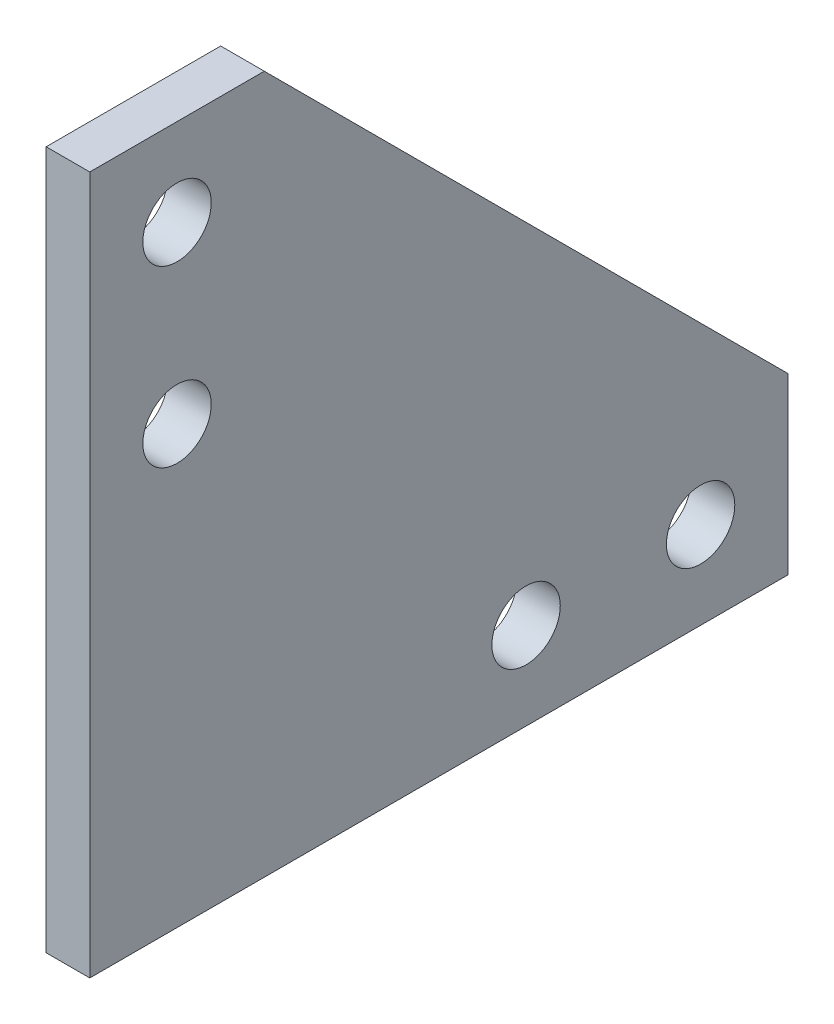
ISO-10303-21;
HEADER;
FILE_DESCRIPTION(('STEP AP214'),'2;1');
FILE_NAME('part.step','',(''),(''),'','','');
FILE_SCHEMA(('AUTOMOTIVE_DESIGN { 1 0 10303 214 1 1 1 1 }'));
ENDSEC;
DATA;
#1=APPLICATION_CONTEXT('core data for automotive mechanical design processes');
#2=APPLICATION_PROTOCOL_DEFINITION('international standard','automotive_design',2000,#1);
#3=PRODUCT_CONTEXT('',#1,'mechanical');
#4=PRODUCT('Part','Part','',(#3));
#5=PRODUCT_RELATED_PRODUCT_CATEGORY('part','',(#4));
#6=PRODUCT_DEFINITION_FORMATION('','',#4);
#7=PRODUCT_DEFINITION_CONTEXT('part definition',#1,'design');
#8=PRODUCT_DEFINITION('design','',#6,#7);
#9=PRODUCT_DEFINITION_SHAPE('','',#8);
#10=(LENGTH_UNIT() NAMED_UNIT(*) SI_UNIT(.MILLI.,.METRE.));
#11=(NAMED_UNIT(*) PLANE_ANGLE_UNIT() SI_UNIT($,.RADIAN.));
#12=(NAMED_UNIT(*) SI_UNIT($,.STERADIAN.) SOLID_ANGLE_UNIT());
#13=UNCERTAINTY_MEASURE_WITH_UNIT(LENGTH_MEASURE(1.E-05),#10,'distance_accuracy_value','');
#14=(GEOMETRIC_REPRESENTATION_CONTEXT(3) GLOBAL_UNCERTAINTY_ASSIGNED_CONTEXT((#13)) GLOBAL_UNIT_ASSIGNED_CONTEXT((#10,
#11,#12)) REPRESENTATION_CONTEXT('',''));
#15=CARTESIAN_POINT('',(0.,0.,0.));
#16=DIRECTION('',(0.,0.,1.));
#17=DIRECTION('',(1.,0.,0.));
#18=AXIS2_PLACEMENT_3D('',#15,#16,#17);
#19=CARTESIAN_POINT('',(3.175,0.,0.));
#20=DIRECTION('',(1.,0.,0.));
#21=DIRECTION('',(0.,0.,-1.));
#22=AXIS2_PLACEMENT_3D('',#19,#20,#21);
#23=PLANE('',#22);
#24=CARTESIAN_POINT('',(3.175,6.35,-31.75));
#25=DIRECTION('',(1.,0.,0.));
#26=DIRECTION('',(0.,0.,-1.));
#27=AXIS2_PLACEMENT_3D('',#24,#25,#26);
#28=CIRCLE('',#27,2.4892);
#29=CARTESIAN_POINT('',(3.175,6.35,-34.2392));
#30=VERTEX_POINT('',#29);
#31=EDGE_CURVE('E174',#30,#30,#28,.T.);
#32=ORIENTED_EDGE('',*,*,#31,.F.);
#33=EDGE_LOOP('',(#32));
#34=FACE_BOUND('',#33,.T.);
#35=CARTESIAN_POINT('',(3.175,31.75,-6.35000000000006));
#36=DIRECTION('',(1.,0.,0.));
#37=DIRECTION('',(0.,0.,-1.));
#38=AXIS2_PLACEMENT_3D('',#35,#36,#37);
#39=CIRCLE('',#38,2.4892);
#40=CARTESIAN_POINT('',(3.175,31.75,-8.83920000000006));
#41=VERTEX_POINT('',#40);
#42=EDGE_CURVE('E114',#41,#41,#39,.T.);
#43=ORIENTED_EDGE('',*,*,#42,.F.);
#44=EDGE_LOOP('',(#43));
#45=FACE_BOUND('',#44,.T.);
#46=DIRECTION('',(0.,-1.,0.));
#47=VECTOR('',#46,1.);
#48=CARTESIAN_POINT('',(3.175,50.8,0.));
#49=LINE('',#48,#47);
#50=CARTESIAN_POINT('',(3.175,50.8,0.));
#51=VERTEX_POINT('',#50);
#52=CARTESIAN_POINT('',(3.175,0.,0.));
#53=VERTEX_POINT('',#52);
#54=EDGE_CURVE('E119',#51,#53,#49,.T.);
#55=ORIENTED_EDGE('',*,*,#54,.T.);
#56=DIRECTION('',(0.,0.,-1.));
#57=VECTOR('',#56,1.);
#58=CARTESIAN_POINT('',(3.175,0.,0.));
#59=LINE('',#58,#57);
#60=CARTESIAN_POINT('',(3.175,0.,-50.8));
#61=VERTEX_POINT('',#60);
#62=EDGE_CURVE('E86',#53,#61,#59,.T.);
#63=ORIENTED_EDGE('',*,*,#62,.T.);
#64=DIRECTION('',(0.,1.,0.));
#65=VECTOR('',#64,1.);
#66=CARTESIAN_POINT('',(3.175,0.,-50.8));
#67=LINE('',#66,#65);
#68=CARTESIAN_POINT('',(3.175,12.7,-50.8));
#69=VERTEX_POINT('',#68);
#70=EDGE_CURVE('E90',#61,#69,#67,.T.);
#71=ORIENTED_EDGE('',*,*,#70,.T.);
#72=DIRECTION('',(0.,0.707106781186549,0.707106781186546));
#73=VECTOR('',#72,1.);
#74=CARTESIAN_POINT('',(3.175,12.7,-50.8));
#75=LINE('',#74,#73);
#76=CARTESIAN_POINT('',(3.175,50.8,-12.7000000000001));
#77=VERTEX_POINT('',#76);
#78=EDGE_CURVE('E94',#69,#77,#75,.T.);
#79=ORIENTED_EDGE('',*,*,#78,.T.);
#80=DIRECTION('',(0.,0.,1.));
#81=VECTOR('',#80,1.);
#82=CARTESIAN_POINT('',(3.175,50.8,-12.7000000000001));
#83=LINE('',#82,#81);
#84=EDGE_CURVE('E52',#77,#51,#83,.T.);
#85=ORIENTED_EDGE('',*,*,#84,.T.);
#86=EDGE_LOOP('',(#55,#63,#71,#79,#85));
#87=FACE_BOUND('',#86,.T.);
#88=CARTESIAN_POINT('',(3.175,44.45,-6.35000000000006));
#89=DIRECTION('',(1.,0.,0.));
#90=DIRECTION('',(0.,0.,-1.));
#91=AXIS2_PLACEMENT_3D('',#88,#89,#90);
#92=CIRCLE('',#91,2.4892);
#93=CARTESIAN_POINT('',(3.175,44.45,-8.83920000000006));
#94=VERTEX_POINT('',#93);
#95=EDGE_CURVE('E180',#94,#94,#92,.T.);
#96=ORIENTED_EDGE('',*,*,#95,.F.);
#97=EDGE_LOOP('',(#96));
#98=FACE_BOUND('',#97,.T.);
#99=CARTESIAN_POINT('',(3.175,6.35,-44.45));
#100=DIRECTION('',(1.,0.,0.));
#101=DIRECTION('',(0.,0.,-1.));
#102=AXIS2_PLACEMENT_3D('',#99,#100,#101);
#103=CIRCLE('',#102,2.4892);
#104=CARTESIAN_POINT('',(3.175,6.35,-46.9392));
#105=VERTEX_POINT('',#104);
#106=EDGE_CURVE('E165',#105,#105,#103,.T.);
#107=ORIENTED_EDGE('',*,*,#106,.F.);
#108=EDGE_LOOP('',(#107));
#109=FACE_BOUND('',#108,.T.);
#110=ADVANCED_FACE('F35',(#34,#45,#87,#98,#109),#23,.T.);
#111=CARTESIAN_POINT('',(0.,0.,0.));
#112=DIRECTION('',(1.,0.,0.));
#113=DIRECTION('',(0.,0.,-1.));
#114=AXIS2_PLACEMENT_3D('',#111,#112,#113);
#115=PLANE('',#114);
#116=DIRECTION('',(0.,-1.,0.));
#117=VECTOR('',#116,1.);
#118=CARTESIAN_POINT('',(0.,50.8,0.));
#119=LINE('',#118,#117);
#120=CARTESIAN_POINT('',(0.,50.8,0.));
#121=VERTEX_POINT('',#120);
#122=CARTESIAN_POINT('',(0.,0.,0.));
#123=VERTEX_POINT('',#122);
#124=EDGE_CURVE('E110',#121,#123,#119,.T.);
#125=ORIENTED_EDGE('',*,*,#124,.F.);
#126=DIRECTION('',(0.,0.,1.));
#127=VECTOR('',#126,1.);
#128=CARTESIAN_POINT('',(0.,50.8,-12.7000000000001));
#129=LINE('',#128,#127);
#130=CARTESIAN_POINT('',(0.,50.8,-12.7000000000001));
#131=VERTEX_POINT('',#130);
#132=EDGE_CURVE('E78',#131,#121,#129,.T.);
#133=ORIENTED_EDGE('',*,*,#132,.F.);
#134=DIRECTION('',(0.,0.707106781186549,0.707106781186546));
#135=VECTOR('',#134,1.);
#136=CARTESIAN_POINT('',(0.,12.7,-50.8));
#137=LINE('',#136,#135);
#138=CARTESIAN_POINT('',(0.,12.7,-50.8));
#139=VERTEX_POINT('',#138);
#140=EDGE_CURVE('E72',#139,#131,#137,.T.);
#141=ORIENTED_EDGE('',*,*,#140,.F.);
#142=DIRECTION('',(0.,1.,0.));
#143=VECTOR('',#142,1.);
#144=CARTESIAN_POINT('',(0.,0.,-50.8));
#145=LINE('',#144,#143);
#146=CARTESIAN_POINT('',(0.,0.,-50.8));
#147=VERTEX_POINT('',#146);
#148=EDGE_CURVE('E101',#147,#139,#145,.T.);
#149=ORIENTED_EDGE('',*,*,#148,.F.);
#150=DIRECTION('',(0.,0.,-1.));
#151=VECTOR('',#150,1.);
#152=CARTESIAN_POINT('',(0.,0.,0.));
#153=LINE('',#152,#151);
#154=EDGE_CURVE('E113',#123,#147,#153,.T.);
#155=ORIENTED_EDGE('',*,*,#154,.F.);
#156=EDGE_LOOP('',(#125,#133,#141,#149,#155));
#157=FACE_BOUND('',#156,.T.);
#158=CARTESIAN_POINT('',(0.,31.75,-6.35000000000006));
#159=DIRECTION('',(1.,0.,0.));
#160=DIRECTION('',(0.,0.,-1.));
#161=AXIS2_PLACEMENT_3D('',#158,#159,#160);
#162=CIRCLE('',#161,2.4892);
#163=CARTESIAN_POINT('',(0.,31.75,-8.83920000000006));
#164=VERTEX_POINT('',#163);
#165=EDGE_CURVE('E183',#164,#164,#162,.T.);
#166=ORIENTED_EDGE('',*,*,#165,.T.);
#167=EDGE_LOOP('',(#166));
#168=FACE_BOUND('',#167,.T.);
#169=CARTESIAN_POINT('',(0.,44.45,-6.35000000000006));
#170=DIRECTION('',(1.,0.,0.));
#171=DIRECTION('',(0.,0.,-1.));
#172=AXIS2_PLACEMENT_3D('',#169,#170,#171);
#173=CIRCLE('',#172,2.4892);
#174=CARTESIAN_POINT('',(0.,44.45,-8.83920000000006));
#175=VERTEX_POINT('',#174);
#176=EDGE_CURVE('E177',#175,#175,#173,.T.);
#177=ORIENTED_EDGE('',*,*,#176,.T.);
#178=EDGE_LOOP('',(#177));
#179=FACE_BOUND('',#178,.T.);
#180=CARTESIAN_POINT('',(0.,6.35,-31.75));
#181=DIRECTION('',(1.,0.,0.));
#182=DIRECTION('',(0.,0.,-1.));
#183=AXIS2_PLACEMENT_3D('',#180,#181,#182);
#184=CIRCLE('',#183,2.4892);
#185=CARTESIAN_POINT('',(0.,6.35,-34.2392));
#186=VERTEX_POINT('',#185);
#187=EDGE_CURVE('E171',#186,#186,#184,.T.);
#188=ORIENTED_EDGE('',*,*,#187,.T.);
#189=EDGE_LOOP('',(#188));
#190=FACE_BOUND('',#189,.T.);
#191=CARTESIAN_POINT('',(0.,6.35,-44.45));
#192=DIRECTION('',(1.,0.,0.));
#193=DIRECTION('',(0.,0.,-1.));
#194=AXIS2_PLACEMENT_3D('',#191,#192,#193);
#195=CIRCLE('',#194,2.4892);
#196=CARTESIAN_POINT('',(0.,6.35,-46.9392));
#197=VERTEX_POINT('',#196);
#198=EDGE_CURVE('E168',#197,#197,#195,.T.);
#199=ORIENTED_EDGE('',*,*,#198,.T.);
#200=EDGE_LOOP('',(#199));
#201=FACE_BOUND('',#200,.T.);
#202=ADVANCED_FACE('F123',(#157,#168,#179,#190,#201),#115,.F.);
#203=CARTESIAN_POINT('',(3.175,50.8,0.));
#204=DIRECTION('',(0.,0.,-1.));
#205=DIRECTION('',(0.,1.,0.));
#206=AXIS2_PLACEMENT_3D('',#203,#204,#205);
#207=PLANE('',#206);
#208=ORIENTED_EDGE('',*,*,#124,.T.);
#209=DIRECTION('',(-1.,0.,0.));
#210=VECTOR('',#209,1.);
#211=CARTESIAN_POINT('',(3.175,0.,0.));
#212=LINE('',#211,#210);
#213=EDGE_CURVE('E11',#53,#123,#212,.T.);
#214=ORIENTED_EDGE('',*,*,#213,.F.);
#215=ORIENTED_EDGE('',*,*,#54,.F.);
#216=DIRECTION('',(-1.,0.,0.));
#217=VECTOR('',#216,1.);
#218=CARTESIAN_POINT('',(3.175,50.8,0.));
#219=LINE('',#218,#217);
#220=EDGE_CURVE('E106',#51,#121,#219,.T.);
#221=ORIENTED_EDGE('',*,*,#220,.T.);
#222=EDGE_LOOP('',(#208,#214,#215,#221));
#223=FACE_BOUND('',#222,.T.);
#224=ADVANCED_FACE('F37',(#223),#207,.F.);
#225=CARTESIAN_POINT('',(3.175,0.,0.));
#226=DIRECTION('',(0.,1.,0.));
#227=DIRECTION('',(0.,0.,1.));
#228=AXIS2_PLACEMENT_3D('',#225,#226,#227);
#229=PLANE('',#228);
#230=ORIENTED_EDGE('',*,*,#154,.T.);
#231=DIRECTION('',(-1.,0.,0.));
#232=VECTOR('',#231,1.);
#233=CARTESIAN_POINT('',(3.175,0.,-50.8));
#234=LINE('',#233,#232);
#235=EDGE_CURVE('E44',#61,#147,#234,.T.);
#236=ORIENTED_EDGE('',*,*,#235,.F.);
#237=ORIENTED_EDGE('',*,*,#62,.F.);
#238=ORIENTED_EDGE('',*,*,#213,.T.);
#239=EDGE_LOOP('',(#230,#236,#237,#238));
#240=FACE_BOUND('',#239,.T.);
#241=ADVANCED_FACE('F232',(#240),#229,.F.);
#242=CARTESIAN_POINT('',(3.175,0.,-50.8));
#243=DIRECTION('',(0.,0.,1.));
#244=DIRECTION('',(1.,0.,0.));
#245=AXIS2_PLACEMENT_3D('',#242,#243,#244);
#246=PLANE('',#245);
#247=ORIENTED_EDGE('',*,*,#148,.T.);
#248=DIRECTION('',(-1.,0.,0.));
#249=VECTOR('',#248,1.);
#250=CARTESIAN_POINT('',(3.175,12.7,-50.8));
#251=LINE('',#250,#249);
#252=EDGE_CURVE('E98',#69,#139,#251,.T.);
#253=ORIENTED_EDGE('',*,*,#252,.F.);
#254=ORIENTED_EDGE('',*,*,#70,.F.);
#255=ORIENTED_EDGE('',*,*,#235,.T.);
#256=EDGE_LOOP('',(#247,#253,#254,#255));
#257=FACE_BOUND('',#256,.T.);
#258=ADVANCED_FACE('F99',(#257),#246,.F.);
#259=CARTESIAN_POINT('',(3.175,12.7,-50.8));
#260=DIRECTION('',(0.,-0.707106781186546,0.707106781186548));
#261=DIRECTION('',(0.,-0.707106781186549,-0.707106781186547));
#262=AXIS2_PLACEMENT_3D('',#259,#260,#261);
#263=PLANE('',#262);
#264=ORIENTED_EDGE('',*,*,#140,.T.);
#265=DIRECTION('',(-1.,0.,0.));
#266=VECTOR('',#265,1.);
#267=CARTESIAN_POINT('',(3.175,50.8,-12.7000000000001));
#268=LINE('',#267,#266);
#269=EDGE_CURVE('E102',#77,#131,#268,.T.);
#270=ORIENTED_EDGE('',*,*,#269,.F.);
#271=ORIENTED_EDGE('',*,*,#78,.F.);
#272=ORIENTED_EDGE('',*,*,#252,.T.);
#273=EDGE_LOOP('',(#264,#270,#271,#272));
#274=FACE_BOUND('',#273,.T.);
#275=ADVANCED_FACE('F104',(#274),#263,.F.);
#276=CARTESIAN_POINT('',(3.175,50.8,-12.7000000000001));
#277=DIRECTION('',(0.,-1.,0.));
#278=DIRECTION('',(0.,0.,-1.));
#279=AXIS2_PLACEMENT_3D('',#276,#277,#278);
#280=PLANE('',#279);
#281=ORIENTED_EDGE('',*,*,#132,.T.);
#282=ORIENTED_EDGE('',*,*,#220,.F.);
#283=ORIENTED_EDGE('',*,*,#84,.F.);
#284=ORIENTED_EDGE('',*,*,#269,.T.);
#285=EDGE_LOOP('',(#281,#282,#283,#284));
#286=FACE_BOUND('',#285,.T.);
#287=ADVANCED_FACE('F128',(#286),#280,.F.);
#288=CARTESIAN_POINT('',(3.175,31.75,-6.35000000000006));
#289=DIRECTION('',(-1.,0.,0.));
#290=DIRECTION('',(0.,0.,1.));
#291=AXIS2_PLACEMENT_3D('',#288,#289,#290);
#292=CYLINDRICAL_SURFACE('',#291,2.4892);
#293=ORIENTED_EDGE('',*,*,#42,.T.);
#294=EDGE_LOOP('',(#293));
#295=FACE_BOUND('',#294,.T.);
#296=ORIENTED_EDGE('',*,*,#165,.F.);
#297=EDGE_LOOP('',(#296));
#298=FACE_BOUND('',#297,.T.);
#299=ADVANCED_FACE('F130',(#295,#298),#292,.F.);
#300=CARTESIAN_POINT('',(3.175,44.45,-6.35000000000006));
#301=DIRECTION('',(-1.,0.,0.));
#302=DIRECTION('',(0.,0.,1.));
#303=AXIS2_PLACEMENT_3D('',#300,#301,#302);
#304=CYLINDRICAL_SURFACE('',#303,2.4892);
#305=ORIENTED_EDGE('',*,*,#95,.T.);
#306=EDGE_LOOP('',(#305));
#307=FACE_BOUND('',#306,.T.);
#308=ORIENTED_EDGE('',*,*,#176,.F.);
#309=EDGE_LOOP('',(#308));
#310=FACE_BOUND('',#309,.T.);
#311=ADVANCED_FACE('F136',(#307,#310),#304,.F.);
#312=CARTESIAN_POINT('',(3.175,6.35,-31.75));
#313=DIRECTION('',(-1.,0.,0.));
#314=DIRECTION('',(0.,0.,1.));
#315=AXIS2_PLACEMENT_3D('',#312,#313,#314);
#316=CYLINDRICAL_SURFACE('',#315,2.4892);
#317=ORIENTED_EDGE('',*,*,#31,.T.);
#318=EDGE_LOOP('',(#317));
#319=FACE_BOUND('',#318,.T.);
#320=ORIENTED_EDGE('',*,*,#187,.F.);
#321=EDGE_LOOP('',(#320));
#322=FACE_BOUND('',#321,.T.);
#323=ADVANCED_FACE('F152',(#319,#322),#316,.F.);
#324=CARTESIAN_POINT('',(3.175,6.35,-44.45));
#325=DIRECTION('',(-1.,0.,0.));
#326=DIRECTION('',(0.,0.,1.));
#327=AXIS2_PLACEMENT_3D('',#324,#325,#326);
#328=CYLINDRICAL_SURFACE('',#327,2.4892);
#329=ORIENTED_EDGE('',*,*,#106,.T.);
#330=EDGE_LOOP('',(#329));
#331=FACE_BOUND('',#330,.T.);
#332=ORIENTED_EDGE('',*,*,#198,.F.);
#333=EDGE_LOOP('',(#332));
#334=FACE_BOUND('',#333,.T.);
#335=ADVANCED_FACE('F156',(#331,#334),#328,.F.);
#336=CLOSED_SHELL('',(#110,#202,#224,#241,#258,#275,#287,#299,#311,#323,#335));
#337=MANIFOLD_SOLID_BREP('B2',#336);
#338=ADVANCED_BREP_SHAPE_REPRESENTATION('',(#18,#337),#14);
#339=SHAPE_DEFINITION_REPRESENTATION(#9,#338);
ENDSEC;
END-ISO-10303-21;
